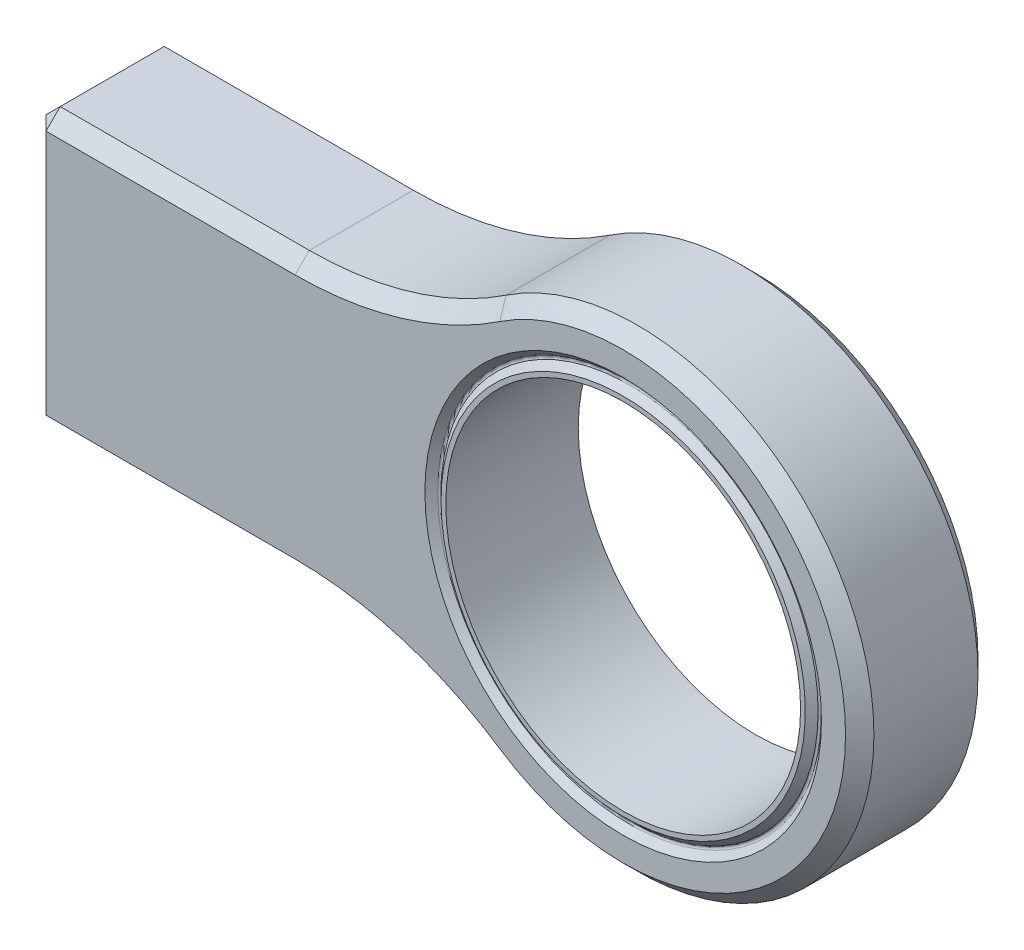
ISO-10303-21;
HEADER;
FILE_DESCRIPTION(('STEP AP214'),'2;1');
FILE_NAME('part.step','',(''),(''),'','','');
FILE_SCHEMA(('AUTOMOTIVE_DESIGN { 1 0 10303 214 1 1 1 1 }'));
ENDSEC;
DATA;
#1=APPLICATION_CONTEXT('core data for automotive mechanical design processes');
#2=APPLICATION_PROTOCOL_DEFINITION('international standard','automotive_design',2000,#1);
#3=PRODUCT_CONTEXT('',#1,'mechanical');
#4=PRODUCT('Part','Part','',(#3));
#5=PRODUCT_RELATED_PRODUCT_CATEGORY('part','',(#4));
#6=PRODUCT_DEFINITION_FORMATION('','',#4);
#7=PRODUCT_DEFINITION_CONTEXT('part definition',#1,'design');
#8=PRODUCT_DEFINITION('design','',#6,#7);
#9=PRODUCT_DEFINITION_SHAPE('','',#8);
#10=(LENGTH_UNIT() NAMED_UNIT(*) SI_UNIT(.MILLI.,.METRE.));
#11=(NAMED_UNIT(*) PLANE_ANGLE_UNIT() SI_UNIT($,.RADIAN.));
#12=(NAMED_UNIT(*) SI_UNIT($,.STERADIAN.) SOLID_ANGLE_UNIT());
#13=UNCERTAINTY_MEASURE_WITH_UNIT(LENGTH_MEASURE(1.E-05),#10,'distance_accuracy_value','');
#14=(GEOMETRIC_REPRESENTATION_CONTEXT(3) GLOBAL_UNCERTAINTY_ASSIGNED_CONTEXT((#13)) GLOBAL_UNIT_ASSIGNED_CONTEXT((#10,
#11,#12)) REPRESENTATION_CONTEXT('',''));
#15=CARTESIAN_POINT('',(0.,0.,0.));
#16=DIRECTION('',(0.,0.,1.));
#17=DIRECTION('',(1.,0.,0.));
#18=AXIS2_PLACEMENT_3D('',#15,#16,#17);
#19=CARTESIAN_POINT('',(0.,0.,3.556));
#20=DIRECTION('',(0.,0.,1.));
#21=DIRECTION('',(1.,0.,0.));
#22=AXIS2_PLACEMENT_3D('',#19,#20,#21);
#23=PLANE('',#22);
#24=CARTESIAN_POINT('',(0.,0.,3.556));
#25=DIRECTION('',(0.,0.,-1.));
#26=DIRECTION('',(-1.,0.,0.));
#27=AXIS2_PLACEMENT_3D('',#24,#25,#26);
#28=CIRCLE('',#27,9.779);
#29=CARTESIAN_POINT('',(-9.779,0.,3.556));
#30=VERTEX_POINT('',#29);
#31=EDGE_CURVE('E404',#30,#30,#28,.T.);
#32=ORIENTED_EDGE('',*,*,#31,.F.);
#33=EDGE_LOOP('',(#32));
#34=FACE_BOUND('',#33,.T.);
#35=CARTESIAN_POINT('',(0.,0.,3.556));
#36=DIRECTION('',(0.,0.,1.));
#37=DIRECTION('',(1.,0.,0.));
#38=AXIS2_PLACEMENT_3D('',#35,#36,#37);
#39=CIRCLE('',#38,9.525);
#40=CARTESIAN_POINT('',(9.525,0.,3.556));
#41=VERTEX_POINT('',#40);
#42=EDGE_CURVE('E169',#41,#41,#39,.T.);
#43=ORIENTED_EDGE('',*,*,#42,.F.);
#44=EDGE_LOOP('',(#43));
#45=FACE_BOUND('',#44,.T.);
#46=ADVANCED_FACE('F41',(#34,#45),#23,.T.);
#47=CARTESIAN_POINT('',(0.,0.,-3.556));
#48=DIRECTION('',(0.,0.,1.));
#49=DIRECTION('',(1.,0.,0.));
#50=AXIS2_PLACEMENT_3D('',#47,#48,#49);
#51=PLANE('',#50);
#52=CARTESIAN_POINT('',(0.,0.,-3.556));
#53=DIRECTION('',(0.,0.,-1.));
#54=DIRECTION('',(-1.,0.,0.));
#55=AXIS2_PLACEMENT_3D('',#52,#53,#54);
#56=CIRCLE('',#55,9.779);
#57=CARTESIAN_POINT('',(-9.779,0.,-3.556));
#58=VERTEX_POINT('',#57);
#59=EDGE_CURVE('E270',#58,#58,#56,.T.);
#60=ORIENTED_EDGE('',*,*,#59,.T.);
#61=EDGE_LOOP('',(#60));
#62=FACE_BOUND('',#61,.T.);
#63=CARTESIAN_POINT('',(0.,0.,-3.556));
#64=DIRECTION('',(0.,0.,1.));
#65=DIRECTION('',(1.,0.,0.));
#66=AXIS2_PLACEMENT_3D('',#63,#64,#65);
#67=CIRCLE('',#66,9.525);
#68=CARTESIAN_POINT('',(9.525,0.,-3.556));
#69=VERTEX_POINT('',#68);
#70=EDGE_CURVE('E201',#69,#69,#67,.T.);
#71=ORIENTED_EDGE('',*,*,#70,.T.);
#72=EDGE_LOOP('',(#71));
#73=FACE_BOUND('',#72,.T.);
#74=ADVANCED_FACE('F372',(#62,#73),#51,.F.);
#75=CARTESIAN_POINT('',(0.,0.,3.556));
#76=DIRECTION('',(0.,0.,-1.));
#77=DIRECTION('',(-1.,0.,0.));
#78=AXIS2_PLACEMENT_3D('',#75,#76,#77);
#79=CIRCLE('',#78,10.6462102448428);
#80=CARTESIAN_POINT('',(-10.6462102448428,0.,3.556));
#81=VERTEX_POINT('',#80);
#82=EDGE_CURVE('E394',#81,#81,#79,.T.);
#83=ORIENTED_EDGE('',*,*,#82,.T.);
#84=EDGE_LOOP('',(#83));
#85=FACE_BOUND('',#84,.T.);
#86=CARTESIAN_POINT('',(-17.6141262627472,26.416,3.556));
#87=DIRECTION('',(0.,0.,1.));
#88=DIRECTION('',(1.,0.,0.));
#89=AXIS2_PLACEMENT_3D('',#86,#87,#88);
#90=CIRCLE('',#89,19.812);
#91=CARTESIAN_POINT('',(-6.62291147479294,9.93241600000001,3.556));
#92=VERTEX_POINT('',#91);
#93=CARTESIAN_POINT('',(-17.6141262627472,6.60400000000001,3.556));
#94=VERTEX_POINT('',#93);
#95=EDGE_CURVE('E244',#92,#94,#90,.F.);
#96=ORIENTED_EDGE('',*,*,#95,.T.);
#97=DIRECTION('',(-1.,0.,0.));
#98=VECTOR('',#97,1.);
#99=CARTESIAN_POINT('',(-31.75,6.60400000000001,3.556));
#100=LINE('',#99,#98);
#101=CARTESIAN_POINT('',(-30.988,6.60400000000001,3.556));
#102=VERTEX_POINT('',#101);
#103=EDGE_CURVE('E180',#94,#102,#100,.T.);
#104=ORIENTED_EDGE('',*,*,#103,.T.);
#105=DIRECTION('',(0.,-1.,0.));
#106=VECTOR('',#105,1.);
#107=CARTESIAN_POINT('',(-30.988,-7.366,3.556));
#108=LINE('',#107,#106);
#109=CARTESIAN_POINT('',(-30.988,-6.60400000000001,3.556));
#110=VERTEX_POINT('',#109);
#111=EDGE_CURVE('E238',#102,#110,#108,.T.);
#112=ORIENTED_EDGE('',*,*,#111,.T.);
#113=DIRECTION('',(1.,0.,0.));
#114=VECTOR('',#113,1.);
#115=CARTESIAN_POINT('',(-17.6141262627472,-6.60400000000001,3.556));
#116=LINE('',#115,#114);
#117=CARTESIAN_POINT('',(-17.6141262627472,-6.60400000000001,3.556));
#118=VERTEX_POINT('',#117);
#119=EDGE_CURVE('E236',#110,#118,#116,.T.);
#120=ORIENTED_EDGE('',*,*,#119,.T.);
#121=CARTESIAN_POINT('',(-17.6141262627472,-26.416,3.556));
#122=DIRECTION('',(0.,0.,1.));
#123=DIRECTION('',(1.,0.,0.));
#124=AXIS2_PLACEMENT_3D('',#121,#122,#123);
#125=CIRCLE('',#124,19.812);
#126=CARTESIAN_POINT('',(-6.62291147479294,-9.93241600000001,3.556));
#127=VERTEX_POINT('',#126);
#128=EDGE_CURVE('E240',#118,#127,#125,.F.);
#129=ORIENTED_EDGE('',*,*,#128,.T.);
#130=CARTESIAN_POINT('',(0.,0.,3.556));
#131=DIRECTION('',(0.,0.,1.));
#132=DIRECTION('',(1.,0.,0.));
#133=AXIS2_PLACEMENT_3D('',#130,#131,#132);
#134=CIRCLE('',#133,11.938);
#135=EDGE_CURVE('E242',#127,#92,#134,.T.);
#136=ORIENTED_EDGE('',*,*,#135,.T.);
#137=EDGE_LOOP('',(#96,#104,#112,#120,#129,#136));
#138=FACE_BOUND('',#137,.T.);
#139=ADVANCED_FACE('F344',(#85,#138),#23,.T.);
#140=CARTESIAN_POINT('',(0.,0.,-3.556));
#141=DIRECTION('',(0.,0.,-1.));
#142=DIRECTION('',(-1.,0.,0.));
#143=AXIS2_PLACEMENT_3D('',#140,#141,#142);
#144=CIRCLE('',#143,10.6462102448428);
#145=CARTESIAN_POINT('',(-10.6462102448428,0.,-3.556));
#146=VERTEX_POINT('',#145);
#147=EDGE_CURVE('E407',#146,#146,#144,.T.);
#148=ORIENTED_EDGE('',*,*,#147,.F.);
#149=EDGE_LOOP('',(#148));
#150=FACE_BOUND('',#149,.T.);
#151=DIRECTION('',(0.,1.,0.));
#152=VECTOR('',#151,1.);
#153=CARTESIAN_POINT('',(-30.988,0.,-3.556));
#154=LINE('',#153,#152);
#155=CARTESIAN_POINT('',(-30.988,-6.60400000000001,-3.556));
#156=VERTEX_POINT('',#155);
#157=CARTESIAN_POINT('',(-30.988,6.60400000000001,-3.556));
#158=VERTEX_POINT('',#157);
#159=EDGE_CURVE('E223',#156,#158,#154,.T.);
#160=ORIENTED_EDGE('',*,*,#159,.T.);
#161=DIRECTION('',(1.,0.,0.));
#162=VECTOR('',#161,1.);
#163=CARTESIAN_POINT('',(0.,6.60400000000001,-3.556));
#164=LINE('',#163,#162);
#165=CARTESIAN_POINT('',(-17.6141262627472,6.60400000000001,-3.556));
#166=VERTEX_POINT('',#165);
#167=EDGE_CURVE('E233',#158,#166,#164,.T.);
#168=ORIENTED_EDGE('',*,*,#167,.T.);
#169=CARTESIAN_POINT('',(-17.6141262627472,26.416,-3.556));
#170=DIRECTION('',(0.,0.,1.));
#171=DIRECTION('',(1.,0.,0.));
#172=AXIS2_PLACEMENT_3D('',#169,#170,#171);
#173=CIRCLE('',#172,19.812);
#174=CARTESIAN_POINT('',(-6.62291147479294,9.93241600000001,-3.556));
#175=VERTEX_POINT('',#174);
#176=EDGE_CURVE('E231',#166,#175,#173,.T.);
#177=ORIENTED_EDGE('',*,*,#176,.T.);
#178=CARTESIAN_POINT('',(0.,0.,-3.556));
#179=DIRECTION('',(0.,0.,1.));
#180=DIRECTION('',(1.,0.,0.));
#181=AXIS2_PLACEMENT_3D('',#178,#179,#180);
#182=CIRCLE('',#181,11.938);
#183=CARTESIAN_POINT('',(-6.62291147479294,-9.93241600000001,-3.556));
#184=VERTEX_POINT('',#183);
#185=EDGE_CURVE('E229',#175,#184,#182,.F.);
#186=ORIENTED_EDGE('',*,*,#185,.T.);
#187=CARTESIAN_POINT('',(-17.6141262627472,-26.416,-3.556));
#188=DIRECTION('',(0.,0.,1.));
#189=DIRECTION('',(1.,0.,0.));
#190=AXIS2_PLACEMENT_3D('',#187,#188,#189);
#191=CIRCLE('',#190,19.812);
#192=CARTESIAN_POINT('',(-17.6141262627472,-6.60400000000001,-3.556));
#193=VERTEX_POINT('',#192);
#194=EDGE_CURVE('E227',#184,#193,#191,.T.);
#195=ORIENTED_EDGE('',*,*,#194,.T.);
#196=DIRECTION('',(-1.,0.,0.));
#197=VECTOR('',#196,1.);
#198=CARTESIAN_POINT('',(0.,-6.60400000000001,-3.556));
#199=LINE('',#198,#197);
#200=EDGE_CURVE('E225',#193,#156,#199,.T.);
#201=ORIENTED_EDGE('',*,*,#200,.T.);
#202=EDGE_LOOP('',(#160,#168,#177,#186,#195,#201));
#203=FACE_BOUND('',#202,.T.);
#204=ADVANCED_FACE('F382',(#150,#203),#51,.F.);
#205=CARTESIAN_POINT('',(-31.75,7.366,3.556));
#206=DIRECTION('',(0.,-1.,0.));
#207=DIRECTION('',(0.,0.,-1.));
#208=AXIS2_PLACEMENT_3D('',#205,#206,#207);
#209=PLANE('',#208);
#210=DIRECTION('',(0.,0.,1.));
#211=VECTOR('',#210,1.);
#212=CARTESIAN_POINT('',(-17.6141262627472,7.366,-3.556));
#213=LINE('',#212,#211);
#214=CARTESIAN_POINT('',(-17.6141262627472,7.366,2.794));
#215=VERTEX_POINT('',#214);
#216=CARTESIAN_POINT('',(-17.6141262627472,7.366,-2.794));
#217=VERTEX_POINT('',#216);
#218=EDGE_CURVE('E150',#215,#217,#213,.F.);
#219=ORIENTED_EDGE('',*,*,#218,.T.);
#220=DIRECTION('',(-1.,0.,0.));
#221=VECTOR('',#220,1.);
#222=CARTESIAN_POINT('',(-31.75,7.366,-2.794));
#223=LINE('',#222,#221);
#224=CARTESIAN_POINT('',(-30.988,7.366,-2.794));
#225=VERTEX_POINT('',#224);
#226=EDGE_CURVE('E158',#217,#225,#223,.T.);
#227=ORIENTED_EDGE('',*,*,#226,.T.);
#228=DIRECTION('',(0.,0.,1.));
#229=VECTOR('',#228,1.);
#230=CARTESIAN_POINT('',(-30.988,7.366,3.556));
#231=LINE('',#230,#229);
#232=CARTESIAN_POINT('',(-30.988,7.366,2.794));
#233=VERTEX_POINT('',#232);
#234=EDGE_CURVE('E153',#225,#233,#231,.T.);
#235=ORIENTED_EDGE('',*,*,#234,.T.);
#236=DIRECTION('',(1.,0.,0.));
#237=VECTOR('',#236,1.);
#238=CARTESIAN_POINT('',(-17.6141262627472,7.366,2.794));
#239=LINE('',#238,#237);
#240=EDGE_CURVE('E146',#233,#215,#239,.T.);
#241=ORIENTED_EDGE('',*,*,#240,.T.);
#242=EDGE_LOOP('',(#219,#227,#235,#241));
#243=FACE_BOUND('',#242,.T.);
#244=ADVANCED_FACE('F148',(#243),#209,.F.);
#245=CARTESIAN_POINT('',(-31.75,7.366,3.556));
#246=DIRECTION('',(1.,0.,0.));
#247=DIRECTION('',(0.,0.,-1.));
#248=AXIS2_PLACEMENT_3D('',#245,#246,#247);
#249=PLANE('',#248);
#250=DIRECTION('',(0.,1.,0.));
#251=VECTOR('',#250,1.);
#252=CARTESIAN_POINT('',(-31.75,7.366,2.794));
#253=LINE('',#252,#251);
#254=CARTESIAN_POINT('',(-31.75,-6.60400000000001,2.794));
#255=VERTEX_POINT('',#254);
#256=CARTESIAN_POINT('',(-31.75,6.60400000000001,2.794));
#257=VERTEX_POINT('',#256);
#258=EDGE_CURVE('E262',#255,#257,#253,.T.);
#259=ORIENTED_EDGE('',*,*,#258,.T.);
#260=DIRECTION('',(0.,0.,-1.));
#261=VECTOR('',#260,1.);
#262=CARTESIAN_POINT('',(-31.75,6.60400000000001,3.556));
#263=LINE('',#262,#261);
#264=CARTESIAN_POINT('',(-31.75,6.60400000000001,-2.79400000000001));
#265=VERTEX_POINT('',#264);
#266=EDGE_CURVE('E11',#257,#265,#263,.T.);
#267=ORIENTED_EDGE('',*,*,#266,.T.);
#268=DIRECTION('',(0.,-1.,0.));
#269=VECTOR('',#268,1.);
#270=CARTESIAN_POINT('',(-31.75,7.366,-2.79400000000001));
#271=LINE('',#270,#269);
#272=CARTESIAN_POINT('',(-31.75,-6.60400000000001,-2.79400000000001));
#273=VERTEX_POINT('',#272);
#274=EDGE_CURVE('E51',#265,#273,#271,.T.);
#275=ORIENTED_EDGE('',*,*,#274,.T.);
#276=DIRECTION('',(0.,0.,1.));
#277=VECTOR('',#276,1.);
#278=CARTESIAN_POINT('',(-31.75,-6.60400000000001,3.556));
#279=LINE('',#278,#277);
#280=EDGE_CURVE('E264',#273,#255,#279,.T.);
#281=ORIENTED_EDGE('',*,*,#280,.T.);
#282=EDGE_LOOP('',(#259,#267,#275,#281));
#283=FACE_BOUND('',#282,.T.);
#284=ADVANCED_FACE('F315',(#283),#249,.F.);
#285=CARTESIAN_POINT('',(-31.75,-7.366,3.556));
#286=DIRECTION('',(0.,1.,0.));
#287=DIRECTION('',(0.,0.,1.));
#288=AXIS2_PLACEMENT_3D('',#285,#286,#287);
#289=PLANE('',#288);
#290=DIRECTION('',(0.,0.,-1.));
#291=VECTOR('',#290,1.);
#292=CARTESIAN_POINT('',(-30.988,-7.366,3.556));
#293=LINE('',#292,#291);
#294=CARTESIAN_POINT('',(-30.988,-7.366,2.794));
#295=VERTEX_POINT('',#294);
#296=CARTESIAN_POINT('',(-30.988,-7.366,-2.794));
#297=VERTEX_POINT('',#296);
#298=EDGE_CURVE('E258',#295,#297,#293,.T.);
#299=ORIENTED_EDGE('',*,*,#298,.T.);
#300=DIRECTION('',(1.,0.,0.));
#301=VECTOR('',#300,1.);
#302=CARTESIAN_POINT('',(-31.75,-7.366,-2.794));
#303=LINE('',#302,#301);
#304=CARTESIAN_POINT('',(-17.6141262627472,-7.366,-2.794));
#305=VERTEX_POINT('',#304);
#306=EDGE_CURVE('E260',#297,#305,#303,.T.);
#307=ORIENTED_EDGE('',*,*,#306,.T.);
#308=DIRECTION('',(0.,0.,1.));
#309=VECTOR('',#308,1.);
#310=CARTESIAN_POINT('',(-17.6141262627472,-7.366,3.556));
#311=LINE('',#310,#309);
#312=CARTESIAN_POINT('',(-17.6141262627472,-7.366,2.794));
#313=VERTEX_POINT('',#312);
#314=EDGE_CURVE('E218',#305,#313,#311,.T.);
#315=ORIENTED_EDGE('',*,*,#314,.T.);
#316=DIRECTION('',(-1.,0.,0.));
#317=VECTOR('',#316,1.);
#318=CARTESIAN_POINT('',(-31.75,-7.366,2.794));
#319=LINE('',#318,#317);
#320=EDGE_CURVE('E256',#313,#295,#319,.T.);
#321=ORIENTED_EDGE('',*,*,#320,.T.);
#322=EDGE_LOOP('',(#299,#307,#315,#321));
#323=FACE_BOUND('',#322,.T.);
#324=ADVANCED_FACE('F335',(#323),#289,.F.);
#325=CARTESIAN_POINT('',(0.,0.,3.556));
#326=DIRECTION('',(0.,0.,-1.));
#327=DIRECTION('',(-1.,0.,0.));
#328=AXIS2_PLACEMENT_3D('',#325,#326,#327);
#329=CYLINDRICAL_SURFACE('',#328,12.7);
#330=DIRECTION('',(0.,0.,-1.));
#331=VECTOR('',#330,1.);
#332=CARTESIAN_POINT('',(-7.04565050509887,-10.5664,3.556));
#333=LINE('',#332,#331);
#334=CARTESIAN_POINT('',(-7.04565050509887,-10.5664,2.794));
#335=VERTEX_POINT('',#334);
#336=CARTESIAN_POINT('',(-7.04565050509887,-10.5664,-2.794));
#337=VERTEX_POINT('',#336);
#338=EDGE_CURVE('E168',#335,#337,#333,.T.);
#339=ORIENTED_EDGE('',*,*,#338,.T.);
#340=CARTESIAN_POINT('',(0.,0.,-2.794));
#341=DIRECTION('',(0.,0.,1.));
#342=DIRECTION('',(1.,0.,0.));
#343=AXIS2_PLACEMENT_3D('',#340,#341,#342);
#344=CIRCLE('',#343,12.7);
#345=CARTESIAN_POINT('',(-7.04565050509887,10.5664,-2.794));
#346=VERTEX_POINT('',#345);
#347=EDGE_CURVE('E250',#337,#346,#344,.T.);
#348=ORIENTED_EDGE('',*,*,#347,.T.);
#349=DIRECTION('',(0.,0.,-1.));
#350=VECTOR('',#349,1.);
#351=CARTESIAN_POINT('',(-7.04565050509887,10.5664,3.556));
#352=LINE('',#351,#350);
#353=CARTESIAN_POINT('',(-7.04565050509887,10.5664,2.794));
#354=VERTEX_POINT('',#353);
#355=EDGE_CURVE('E216',#346,#354,#352,.F.);
#356=ORIENTED_EDGE('',*,*,#355,.T.);
#357=CARTESIAN_POINT('',(0.,0.,2.794));
#358=DIRECTION('',(0.,0.,1.));
#359=DIRECTION('',(1.,0.,0.));
#360=AXIS2_PLACEMENT_3D('',#357,#358,#359);
#361=CIRCLE('',#360,12.7);
#362=EDGE_CURVE('E248',#354,#335,#361,.F.);
#363=ORIENTED_EDGE('',*,*,#362,.T.);
#364=EDGE_LOOP('',(#339,#348,#356,#363));
#365=FACE_BOUND('',#364,.T.);
#366=ADVANCED_FACE('F347',(#365),#329,.T.);
#367=CARTESIAN_POINT('',(0.,0.,3.556));
#368=DIRECTION('',(0.,0.,-1.));
#369=DIRECTION('',(-1.,0.,0.));
#370=AXIS2_PLACEMENT_3D('',#367,#368,#369);
#371=CYLINDRICAL_SURFACE('',#370,9.525);
#372=ORIENTED_EDGE('',*,*,#42,.T.);
#373=EDGE_LOOP('',(#372));
#374=FACE_BOUND('',#373,.T.);
#375=ORIENTED_EDGE('',*,*,#70,.F.);
#376=EDGE_LOOP('',(#375));
#377=FACE_BOUND('',#376,.T.);
#378=ADVANCED_FACE('F429',(#374,#377),#371,.F.);
#379=CARTESIAN_POINT('',(-17.6141262627472,26.416,3.556));
#380=DIRECTION('',(0.,0.,-1.));
#381=DIRECTION('',(-1.,0.,0.));
#382=AXIS2_PLACEMENT_3D('',#379,#380,#381);
#383=CYLINDRICAL_SURFACE('',#382,19.05);
#384=ORIENTED_EDGE('',*,*,#355,.F.);
#385=CARTESIAN_POINT('',(-17.6141262627472,26.416,-2.794));
#386=DIRECTION('',(0.,0.,1.));
#387=DIRECTION('',(1.,0.,0.));
#388=AXIS2_PLACEMENT_3D('',#385,#386,#387);
#389=CIRCLE('',#388,19.05);
#390=EDGE_CURVE('E167',#346,#217,#389,.F.);
#391=ORIENTED_EDGE('',*,*,#390,.T.);
#392=ORIENTED_EDGE('',*,*,#218,.F.);
#393=CARTESIAN_POINT('',(-17.6141262627472,26.416,2.794));
#394=DIRECTION('',(0.,0.,1.));
#395=DIRECTION('',(1.,0.,0.));
#396=AXIS2_PLACEMENT_3D('',#393,#394,#395);
#397=CIRCLE('',#396,19.05);
#398=EDGE_CURVE('E164',#215,#354,#397,.T.);
#399=ORIENTED_EDGE('',*,*,#398,.T.);
#400=EDGE_LOOP('',(#384,#391,#392,#399));
#401=FACE_BOUND('',#400,.T.);
#402=ADVANCED_FACE('F163',(#401),#383,.F.);
#403=CARTESIAN_POINT('',(-17.6141262627472,-26.416,3.556));
#404=DIRECTION('',(0.,0.,-1.));
#405=DIRECTION('',(-1.,0.,0.));
#406=AXIS2_PLACEMENT_3D('',#403,#404,#405);
#407=CYLINDRICAL_SURFACE('',#406,19.05);
#408=ORIENTED_EDGE('',*,*,#314,.F.);
#409=CARTESIAN_POINT('',(-17.6141262627472,-26.416,-2.794));
#410=DIRECTION('',(0.,0.,1.));
#411=DIRECTION('',(1.,0.,0.));
#412=AXIS2_PLACEMENT_3D('',#409,#410,#411);
#413=CIRCLE('',#412,19.05);
#414=EDGE_CURVE('E254',#305,#337,#413,.F.);
#415=ORIENTED_EDGE('',*,*,#414,.T.);
#416=ORIENTED_EDGE('',*,*,#338,.F.);
#417=CARTESIAN_POINT('',(-17.6141262627472,-26.416,2.794));
#418=DIRECTION('',(0.,0.,1.));
#419=DIRECTION('',(1.,0.,0.));
#420=AXIS2_PLACEMENT_3D('',#417,#418,#419);
#421=CIRCLE('',#420,19.05);
#422=EDGE_CURVE('E252',#335,#313,#421,.T.);
#423=ORIENTED_EDGE('',*,*,#422,.T.);
#424=EDGE_LOOP('',(#408,#415,#416,#423));
#425=FACE_BOUND('',#424,.T.);
#426=ADVANCED_FACE('F337',(#425),#407,.F.);
#427=CARTESIAN_POINT('',(-17.6141262627472,-26.416,3.556));
#428=DIRECTION('',(0.,0.,1.));
#429=DIRECTION('',(1.,0.,0.));
#430=AXIS2_PLACEMENT_3D('',#427,#428,#429);
#431=CONICAL_SURFACE('',#430,19.812,0.785398163397444);
#432=DIRECTION('',(0.,0.707106781186544,0.707106781186551));
#433=VECTOR('',#432,1.);
#434=CARTESIAN_POINT('',(-17.6141262627472,-7.366,2.794));
#435=LINE('',#434,#433);
#436=EDGE_CURVE('E194',#313,#118,#435,.T.);
#437=ORIENTED_EDGE('',*,*,#436,.F.);
#438=ORIENTED_EDGE('',*,*,#422,.F.);
#439=DIRECTION('',(-0.392285610238253,-0.588312841947205,-0.707106781186551));
#440=VECTOR('',#439,1.);
#441=CARTESIAN_POINT('',(-6.62291147479294,-9.93241600000001,3.556));
#442=LINE('',#441,#440);
#443=EDGE_CURVE('E46',#127,#335,#442,.T.);
#444=ORIENTED_EDGE('',*,*,#443,.F.);
#445=ORIENTED_EDGE('',*,*,#128,.F.);
#446=EDGE_LOOP('',(#437,#438,#444,#445));
#447=FACE_BOUND('',#446,.T.);
#448=ADVANCED_FACE('F44',(#447),#431,.F.);
#449=CARTESIAN_POINT('',(0.,0.,3.556));
#450=DIRECTION('',(0.,0.,-1.));
#451=DIRECTION('',(-1.,0.,0.));
#452=AXIS2_PLACEMENT_3D('',#449,#450,#451);
#453=CONICAL_SURFACE('',#452,11.938,0.785398163397444);
#454=ORIENTED_EDGE('',*,*,#443,.T.);
#455=ORIENTED_EDGE('',*,*,#362,.F.);
#456=DIRECTION('',(-0.392285610238253,0.588312841947205,-0.707106781186551));
#457=VECTOR('',#456,1.);
#458=CARTESIAN_POINT('',(-6.62291147479294,9.93241600000001,3.556));
#459=LINE('',#458,#457);
#460=EDGE_CURVE('E179',#92,#354,#459,.T.);
#461=ORIENTED_EDGE('',*,*,#460,.F.);
#462=ORIENTED_EDGE('',*,*,#135,.F.);
#463=EDGE_LOOP('',(#454,#455,#461,#462));
#464=FACE_BOUND('',#463,.T.);
#465=ADVANCED_FACE('F345',(#464),#453,.T.);
#466=CARTESIAN_POINT('',(0.,-6.60400000000001,3.556));
#467=DIRECTION('',(0.,-0.707106781186551,0.707106781186544));
#468=DIRECTION('',(-1.,0.,0.));
#469=AXIS2_PLACEMENT_3D('',#466,#467,#468);
#470=PLANE('',#469);
#471=ORIENTED_EDGE('',*,*,#436,.T.);
#472=ORIENTED_EDGE('',*,*,#119,.F.);
#473=DIRECTION('',(0.,0.707106781186544,0.707106781186551));
#474=VECTOR('',#473,1.);
#475=CARTESIAN_POINT('',(-30.988,-6.985,3.175));
#476=LINE('',#475,#474);
#477=EDGE_CURVE('E184',#295,#110,#476,.T.);
#478=ORIENTED_EDGE('',*,*,#477,.F.);
#479=ORIENTED_EDGE('',*,*,#320,.F.);
#480=EDGE_LOOP('',(#471,#472,#478,#479));
#481=FACE_BOUND('',#480,.T.);
#482=ADVANCED_FACE('F342',(#481),#470,.T.);
#483=CARTESIAN_POINT('',(-17.6141262627472,26.416,3.556));
#484=DIRECTION('',(0.,0.,1.));
#485=DIRECTION('',(1.,0.,0.));
#486=AXIS2_PLACEMENT_3D('',#483,#484,#485);
#487=CONICAL_SURFACE('',#486,19.812,0.785398163397446);
#488=ORIENTED_EDGE('',*,*,#460,.T.);
#489=ORIENTED_EDGE('',*,*,#398,.F.);
#490=DIRECTION('',(0.,0.707106781186544,-0.707106781186551));
#491=VECTOR('',#490,1.);
#492=CARTESIAN_POINT('',(-17.6141262627472,6.60400000000001,3.556));
#493=LINE('',#492,#491);
#494=EDGE_CURVE('E176',#94,#215,#493,.T.);
#495=ORIENTED_EDGE('',*,*,#494,.F.);
#496=ORIENTED_EDGE('',*,*,#95,.F.);
#497=EDGE_LOOP('',(#488,#489,#495,#496));
#498=FACE_BOUND('',#497,.T.);
#499=ADVANCED_FACE('F174',(#498),#487,.F.);
#500=CARTESIAN_POINT('',(-31.75,-6.60400000000001,2.794));
#501=DIRECTION('',(-0.577350269189626,-0.577350269189631,0.577350269189621));
#502=DIRECTION('',(0.707106781186551,-0.707106781186544,0.));
#503=AXIS2_PLACEMENT_3D('',#500,#501,#502);
#504=PLANE('',#503);
#505=DIRECTION('',(-0.707106781186551,0.707106781186544,0.));
#506=VECTOR('',#505,1.);
#507=CARTESIAN_POINT('',(-31.75,-6.60400000000001,2.794));
#508=LINE('',#507,#506);
#509=EDGE_CURVE('E190',#295,#255,#508,.T.);
#510=ORIENTED_EDGE('',*,*,#509,.F.);
#511=ORIENTED_EDGE('',*,*,#477,.T.);
#512=DIRECTION('',(-0.707106781186544,0.,-0.707106781186551));
#513=VECTOR('',#512,1.);
#514=CARTESIAN_POINT('',(-31.75,-6.60400000000001,2.794));
#515=LINE('',#514,#513);
#516=EDGE_CURVE('E185',#255,#110,#515,.F.);
#517=ORIENTED_EDGE('',*,*,#516,.F.);
#518=EDGE_LOOP('',(#510,#511,#517));
#519=FACE_BOUND('',#518,.T.);
#520=ADVANCED_FACE('F308',(#519),#504,.T.);
#521=CARTESIAN_POINT('',(0.,6.60400000000001,3.556));
#522=DIRECTION('',(0.,0.707106781186551,0.707106781186544));
#523=DIRECTION('',(1.,0.,0.));
#524=AXIS2_PLACEMENT_3D('',#521,#522,#523);
#525=PLANE('',#524);
#526=ORIENTED_EDGE('',*,*,#494,.T.);
#527=ORIENTED_EDGE('',*,*,#240,.F.);
#528=DIRECTION('',(0.,0.707106781186544,-0.707106781186551));
#529=VECTOR('',#528,1.);
#530=CARTESIAN_POINT('',(-30.988,6.60400000000001,3.556));
#531=LINE('',#530,#529);
#532=EDGE_CURVE('E295',#102,#233,#531,.T.);
#533=ORIENTED_EDGE('',*,*,#532,.F.);
#534=ORIENTED_EDGE('',*,*,#103,.F.);
#535=EDGE_LOOP('',(#526,#527,#533,#534));
#536=FACE_BOUND('',#535,.T.);
#537=ADVANCED_FACE('F182',(#536),#525,.T.);
#538=CARTESIAN_POINT('',(-30.988,0.,3.556));
#539=DIRECTION('',(-0.707106781186551,0.,0.707106781186544));
#540=DIRECTION('',(0.,1.,0.));
#541=AXIS2_PLACEMENT_3D('',#538,#539,#540);
#542=PLANE('',#541);
#543=ORIENTED_EDGE('',*,*,#516,.T.);
#544=ORIENTED_EDGE('',*,*,#111,.F.);
#545=DIRECTION('',(0.707106781186544,0.,0.707106781186551));
#546=VECTOR('',#545,1.);
#547=CARTESIAN_POINT('',(-30.988,6.60400000000001,3.556));
#548=LINE('',#547,#546);
#549=EDGE_CURVE('E293',#257,#102,#548,.T.);
#550=ORIENTED_EDGE('',*,*,#549,.F.);
#551=ORIENTED_EDGE('',*,*,#258,.F.);
#552=EDGE_LOOP('',(#543,#544,#550,#551));
#553=FACE_BOUND('',#552,.T.);
#554=ADVANCED_FACE('F313',(#553),#542,.T.);
#555=CARTESIAN_POINT('',(-30.988,-7.366,3.556));
#556=DIRECTION('',(0.707106781186544,0.707106781186551,0.));
#557=DIRECTION('',(0.,0.,-1.));
#558=AXIS2_PLACEMENT_3D('',#555,#556,#557);
#559=PLANE('',#558);
#560=ORIENTED_EDGE('',*,*,#509,.T.);
#561=ORIENTED_EDGE('',*,*,#280,.F.);
#562=DIRECTION('',(0.707106781186551,-0.707106781186544,0.));
#563=VECTOR('',#562,1.);
#564=CARTESIAN_POINT('',(-31.369,-6.985,-2.794));
#565=LINE('',#564,#563);
#566=EDGE_CURVE('E290',#297,#273,#565,.F.);
#567=ORIENTED_EDGE('',*,*,#566,.F.);
#568=ORIENTED_EDGE('',*,*,#298,.F.);
#569=EDGE_LOOP('',(#560,#561,#567,#568));
#570=FACE_BOUND('',#569,.T.);
#571=ADVANCED_FACE('F304',(#570),#559,.F.);
#572=CARTESIAN_POINT('',(-31.75,-7.366,-2.794));
#573=DIRECTION('',(0.,0.707106781186551,0.707106781186544));
#574=DIRECTION('',(1.,0.,0.));
#575=AXIS2_PLACEMENT_3D('',#572,#573,#574);
#576=PLANE('',#575);
#577=DIRECTION('',(0.,0.707106781186544,-0.707106781186551));
#578=VECTOR('',#577,1.);
#579=CARTESIAN_POINT('',(-30.988,-6.60400000000001,-3.556));
#580=LINE('',#579,#578);
#581=EDGE_CURVE('E287',#156,#297,#580,.F.);
#582=ORIENTED_EDGE('',*,*,#581,.F.);
#583=ORIENTED_EDGE('',*,*,#200,.F.);
#584=DIRECTION('',(0.,0.707106781186544,-0.707106781186551));
#585=VECTOR('',#584,1.);
#586=CARTESIAN_POINT('',(-17.6141262627472,-7.366,-2.794));
#587=LINE('',#586,#585);
#588=EDGE_CURVE('E297',#305,#193,#587,.T.);
#589=ORIENTED_EDGE('',*,*,#588,.F.);
#590=ORIENTED_EDGE('',*,*,#306,.F.);
#591=EDGE_LOOP('',(#582,#583,#589,#590));
#592=FACE_BOUND('',#591,.T.);
#593=ADVANCED_FACE('F330',(#592),#576,.F.);
#594=CARTESIAN_POINT('',(-17.6141262627472,-26.416,-3.556));
#595=DIRECTION('',(0.,0.,-1.));
#596=DIRECTION('',(-1.,0.,0.));
#597=AXIS2_PLACEMENT_3D('',#594,#595,#596);
#598=CONICAL_SURFACE('',#597,19.812,0.785398163397444);
#599=ORIENTED_EDGE('',*,*,#588,.T.);
#600=ORIENTED_EDGE('',*,*,#194,.F.);
#601=DIRECTION('',(0.392285610238253,0.588312841947205,-0.707106781186551));
#602=VECTOR('',#601,1.);
#603=CARTESIAN_POINT('',(-7.04565050509887,-10.5664,-2.794));
#604=LINE('',#603,#602);
#605=EDGE_CURVE('E284',#337,#184,#604,.T.);
#606=ORIENTED_EDGE('',*,*,#605,.F.);
#607=ORIENTED_EDGE('',*,*,#414,.F.);
#608=EDGE_LOOP('',(#599,#600,#606,#607));
#609=FACE_BOUND('',#608,.T.);
#610=ADVANCED_FACE('F484',(#609),#598,.F.);
#611=CARTESIAN_POINT('',(-30.988,6.60400000000001,3.556));
#612=DIRECTION('',(-0.577350269189626,0.577350269189631,0.577350269189621));
#613=DIRECTION('',(-0.707106781186551,-0.707106781186544,0.));
#614=AXIS2_PLACEMENT_3D('',#611,#612,#613);
#615=PLANE('',#614);
#616=ORIENTED_EDGE('',*,*,#549,.T.);
#617=ORIENTED_EDGE('',*,*,#532,.T.);
#618=DIRECTION('',(0.707106781186551,0.707106781186544,0.));
#619=VECTOR('',#618,1.);
#620=CARTESIAN_POINT('',(-31.369,6.985,2.794));
#621=LINE('',#620,#619);
#622=EDGE_CURVE('E281',#257,#233,#621,.T.);
#623=ORIENTED_EDGE('',*,*,#622,.F.);
#624=EDGE_LOOP('',(#616,#617,#623));
#625=FACE_BOUND('',#624,.T.);
#626=ADVANCED_FACE('F479',(#625),#615,.T.);
#627=CARTESIAN_POINT('',(-30.988,-6.60400000000001,-3.556));
#628=DIRECTION('',(-0.577350269189621,-0.577350269189631,-0.577350269189626));
#629=DIRECTION('',(0.,0.707106781186544,-0.707106781186551));
#630=AXIS2_PLACEMENT_3D('',#627,#628,#629);
#631=PLANE('',#630);
#632=ORIENTED_EDGE('',*,*,#581,.T.);
#633=ORIENTED_EDGE('',*,*,#566,.T.);
#634=DIRECTION('',(-0.707106781186551,0.,0.707106781186544));
#635=VECTOR('',#634,1.);
#636=CARTESIAN_POINT('',(-30.988,-6.60400000000001,-3.556));
#637=LINE('',#636,#635);
#638=EDGE_CURVE('E278',#156,#273,#637,.T.);
#639=ORIENTED_EDGE('',*,*,#638,.F.);
#640=EDGE_LOOP('',(#632,#633,#639));
#641=FACE_BOUND('',#640,.T.);
#642=ADVANCED_FACE('F325',(#641),#631,.T.);
#643=CARTESIAN_POINT('',(0.,0.,-2.794));
#644=DIRECTION('',(0.,0.,1.));
#645=DIRECTION('',(1.,0.,0.));
#646=AXIS2_PLACEMENT_3D('',#643,#644,#645);
#647=CONICAL_SURFACE('',#646,12.7,0.785398163397444);
#648=ORIENTED_EDGE('',*,*,#605,.T.);
#649=ORIENTED_EDGE('',*,*,#185,.F.);
#650=DIRECTION('',(0.392285610238253,-0.588312841947205,-0.707106781186551));
#651=VECTOR('',#650,1.);
#652=CARTESIAN_POINT('',(-7.04565050509887,10.5664,-2.794));
#653=LINE('',#652,#651);
#654=EDGE_CURVE('E275',#346,#175,#653,.T.);
#655=ORIENTED_EDGE('',*,*,#654,.F.);
#656=ORIENTED_EDGE('',*,*,#347,.F.);
#657=EDGE_LOOP('',(#648,#649,#655,#656));
#658=FACE_BOUND('',#657,.T.);
#659=ADVANCED_FACE('F353',(#658),#647,.T.);
#660=CARTESIAN_POINT('',(-31.75,6.60400000000001,3.556));
#661=DIRECTION('',(0.707106781186544,-0.707106781186551,0.));
#662=DIRECTION('',(0.,0.,-1.));
#663=AXIS2_PLACEMENT_3D('',#660,#661,#662);
#664=PLANE('',#663);
#665=ORIENTED_EDGE('',*,*,#622,.T.);
#666=ORIENTED_EDGE('',*,*,#234,.F.);
#667=DIRECTION('',(-0.707106781186551,-0.707106781186544,0.));
#668=VECTOR('',#667,1.);
#669=CARTESIAN_POINT('',(-30.988,7.366,-2.794));
#670=LINE('',#669,#668);
#671=EDGE_CURVE('E273',#265,#225,#670,.F.);
#672=ORIENTED_EDGE('',*,*,#671,.F.);
#673=ORIENTED_EDGE('',*,*,#266,.F.);
#674=EDGE_LOOP('',(#665,#666,#672,#673));
#675=FACE_BOUND('',#674,.T.);
#676=ADVANCED_FACE('F318',(#675),#664,.F.);
#677=CARTESIAN_POINT('',(-31.75,7.366,-2.79400000000001));
#678=DIRECTION('',(0.707106781186544,0.,0.707106781186551));
#679=DIRECTION('',(0.,-1.,0.));
#680=AXIS2_PLACEMENT_3D('',#677,#678,#679);
#681=PLANE('',#680);
#682=ORIENTED_EDGE('',*,*,#638,.T.);
#683=ORIENTED_EDGE('',*,*,#274,.F.);
#684=DIRECTION('',(0.707106781186551,0.,-0.707106781186544));
#685=VECTOR('',#684,1.);
#686=CARTESIAN_POINT('',(-31.369,6.60400000000001,-3.175));
#687=LINE('',#686,#685);
#688=EDGE_CURVE('E59',#158,#265,#687,.F.);
#689=ORIENTED_EDGE('',*,*,#688,.F.);
#690=ORIENTED_EDGE('',*,*,#159,.F.);
#691=EDGE_LOOP('',(#682,#683,#689,#690));
#692=FACE_BOUND('',#691,.T.);
#693=ADVANCED_FACE('F320',(#692),#681,.F.);
#694=CARTESIAN_POINT('',(-17.6141262627472,26.416,-3.556));
#695=DIRECTION('',(0.,0.,-1.));
#696=DIRECTION('',(-1.,0.,0.));
#697=AXIS2_PLACEMENT_3D('',#694,#695,#696);
#698=CONICAL_SURFACE('',#697,19.812,0.785398163397446);
#699=ORIENTED_EDGE('',*,*,#654,.T.);
#700=ORIENTED_EDGE('',*,*,#176,.F.);
#701=DIRECTION('',(0.,-0.707106781186544,-0.707106781186551));
#702=VECTOR('',#701,1.);
#703=CARTESIAN_POINT('',(-17.6141262627472,7.366,-2.794));
#704=LINE('',#703,#702);
#705=EDGE_CURVE('E269',#217,#166,#704,.T.);
#706=ORIENTED_EDGE('',*,*,#705,.F.);
#707=ORIENTED_EDGE('',*,*,#390,.F.);
#708=EDGE_LOOP('',(#699,#700,#706,#707));
#709=FACE_BOUND('',#708,.T.);
#710=ADVANCED_FACE('F356',(#709),#698,.F.);
#711=CARTESIAN_POINT('',(-30.988,7.366,-2.794));
#712=DIRECTION('',(-0.577350269189621,0.577350269189631,-0.577350269189626));
#713=DIRECTION('',(0.,0.707106781186544,0.707106781186551));
#714=AXIS2_PLACEMENT_3D('',#711,#712,#713);
#715=PLANE('',#714);
#716=ORIENTED_EDGE('',*,*,#688,.T.);
#717=ORIENTED_EDGE('',*,*,#671,.T.);
#718=DIRECTION('',(0.,0.707106781186544,0.707106781186551));
#719=VECTOR('',#718,1.);
#720=CARTESIAN_POINT('',(-30.988,7.366,-2.794));
#721=LINE('',#720,#719);
#722=EDGE_CURVE('E267',#158,#225,#721,.T.);
#723=ORIENTED_EDGE('',*,*,#722,.F.);
#724=EDGE_LOOP('',(#716,#717,#723));
#725=FACE_BOUND('',#724,.T.);
#726=ADVANCED_FACE('F360',(#725),#715,.T.);
#727=CARTESIAN_POINT('',(-31.75,7.366,-2.794));
#728=DIRECTION('',(0.,-0.707106781186551,0.707106781186544));
#729=DIRECTION('',(-1.,0.,0.));
#730=AXIS2_PLACEMENT_3D('',#727,#728,#729);
#731=PLANE('',#730);
#732=ORIENTED_EDGE('',*,*,#705,.T.);
#733=ORIENTED_EDGE('',*,*,#167,.F.);
#734=ORIENTED_EDGE('',*,*,#722,.T.);
#735=ORIENTED_EDGE('',*,*,#226,.F.);
#736=EDGE_LOOP('',(#732,#733,#734,#735));
#737=FACE_BOUND('',#736,.T.);
#738=ADVANCED_FACE('F359',(#737),#731,.F.);
#739=CARTESIAN_POINT('',(0.,0.,-3.556));
#740=DIRECTION('',(0.,0.,1.));
#741=DIRECTION('',(1.,0.,0.));
#742=AXIS2_PLACEMENT_3D('',#739,#740,#741);
#743=CONICAL_SURFACE('',#742,9.779,0.785398163397446);
#744=CARTESIAN_POINT('',(0.,0.,-3.21219743878931));
#745=DIRECTION('',(0.,0.,-1.));
#746=DIRECTION('',(-1.,0.,0.));
#747=AXIS2_PLACEMENT_3D('',#744,#745,#746);
#748=CIRCLE('',#747,10.1228025612107);
#749=CARTESIAN_POINT('',(-10.1228025612107,0.,-3.21219743878931));
#750=VERTEX_POINT('',#749);
#751=EDGE_CURVE('E413',#750,#750,#748,.T.);
#752=ORIENTED_EDGE('',*,*,#751,.T.);
#753=EDGE_LOOP('',(#752));
#754=FACE_BOUND('',#753,.T.);
#755=ORIENTED_EDGE('',*,*,#59,.F.);
#756=EDGE_LOOP('',(#755));
#757=FACE_BOUND('',#756,.T.);
#758=ADVANCED_FACE('F367',(#754,#757),#743,.T.);
#759=CARTESIAN_POINT('',(0.,0.,-3.302));
#760=DIRECTION('',(0.,0.,-1.));
#761=DIRECTION('',(-1.,0.,0.));
#762=AXIS2_PLACEMENT_3D('',#759,#760,#761);
#763=TOROIDAL_SURFACE('',#762,10.2126051224214,0.127);
#764=CARTESIAN_POINT('',(0.,0.,-3.21219743878931));
#765=DIRECTION('',(0.,0.,-1.));
#766=DIRECTION('',(-1.,0.,0.));
#767=AXIS2_PLACEMENT_3D('',#764,#765,#766);
#768=CIRCLE('',#767,10.3024076836321);
#769=CARTESIAN_POINT('',(-10.3024076836321,0.,-3.21219743878931));
#770=VERTEX_POINT('',#769);
#771=EDGE_CURVE('E410',#770,#770,#768,.T.);
#772=ORIENTED_EDGE('',*,*,#771,.T.);
#773=EDGE_LOOP('',(#772));
#774=FACE_BOUND('',#773,.T.);
#775=ORIENTED_EDGE('',*,*,#751,.F.);
#776=EDGE_LOOP('',(#775));
#777=FACE_BOUND('',#776,.T.);
#778=ADVANCED_FACE('F419',(#774,#777),#763,.F.);
#779=CARTESIAN_POINT('',(0.,0.,-3.21219743878931));
#780=DIRECTION('',(0.,0.,-1.));
#781=DIRECTION('',(-1.,0.,0.));
#782=AXIS2_PLACEMENT_3D('',#779,#780,#781);
#783=CONICAL_SURFACE('',#782,10.3024076836321,0.785398163397451);
#784=ORIENTED_EDGE('',*,*,#147,.T.);
#785=EDGE_LOOP('',(#784));
#786=FACE_BOUND('',#785,.T.);
#787=ORIENTED_EDGE('',*,*,#771,.F.);
#788=EDGE_LOOP('',(#787));
#789=FACE_BOUND('',#788,.T.);
#790=ADVANCED_FACE('F425',(#786,#789),#783,.F.);
#791=CARTESIAN_POINT('',(0.,0.,3.556));
#792=DIRECTION('',(0.,0.,-1.));
#793=DIRECTION('',(1.,0.,0.));
#794=AXIS2_PLACEMENT_3D('',#791,#792,#793);
#795=CONICAL_SURFACE('',#794,9.779,0.785398163397446);
#796=CARTESIAN_POINT('',(0.,0.,3.21219743878931));
#797=DIRECTION('',(0.,0.,-1.));
#798=DIRECTION('',(-1.,0.,0.));
#799=AXIS2_PLACEMENT_3D('',#796,#797,#798);
#800=CIRCLE('',#799,10.1228025612107);
#801=CARTESIAN_POINT('',(-10.1228025612107,0.,3.21219743878931));
#802=VERTEX_POINT('',#801);
#803=EDGE_CURVE('E399',#802,#802,#800,.T.);
#804=ORIENTED_EDGE('',*,*,#803,.F.);
#805=EDGE_LOOP('',(#804));
#806=FACE_BOUND('',#805,.T.);
#807=ORIENTED_EDGE('',*,*,#31,.T.);
#808=EDGE_LOOP('',(#807));
#809=FACE_BOUND('',#808,.T.);
#810=ADVANCED_FACE('F605',(#806,#809),#795,.T.);
#811=CARTESIAN_POINT('',(0.,0.,3.302));
#812=DIRECTION('',(0.,0.,1.));
#813=DIRECTION('',(-1.,0.,0.));
#814=AXIS2_PLACEMENT_3D('',#811,#812,#813);
#815=TOROIDAL_SURFACE('',#814,10.2126051224214,0.127);
#816=CARTESIAN_POINT('',(0.,0.,3.21219743878931));
#817=DIRECTION('',(0.,0.,-1.));
#818=DIRECTION('',(-1.,0.,0.));
#819=AXIS2_PLACEMENT_3D('',#816,#817,#818);
#820=CIRCLE('',#819,10.3024076836321);
#821=CARTESIAN_POINT('',(-10.3024076836321,0.,3.21219743878931));
#822=VERTEX_POINT('',#821);
#823=EDGE_CURVE('E396',#822,#822,#820,.T.);
#824=ORIENTED_EDGE('',*,*,#823,.F.);
#825=EDGE_LOOP('',(#824));
#826=FACE_BOUND('',#825,.T.);
#827=ORIENTED_EDGE('',*,*,#803,.T.);
#828=EDGE_LOOP('',(#827));
#829=FACE_BOUND('',#828,.T.);
#830=ADVANCED_FACE('F617',(#826,#829),#815,.F.);
#831=CARTESIAN_POINT('',(0.,0.,3.21219743878931));
#832=DIRECTION('',(0.,0.,1.));
#833=DIRECTION('',(-1.,0.,0.));
#834=AXIS2_PLACEMENT_3D('',#831,#832,#833);
#835=CONICAL_SURFACE('',#834,10.3024076836321,0.785398163397451);
#836=ORIENTED_EDGE('',*,*,#82,.F.);
#837=EDGE_LOOP('',(#836));
#838=FACE_BOUND('',#837,.T.);
#839=ORIENTED_EDGE('',*,*,#823,.T.);
#840=EDGE_LOOP('',(#839));
#841=FACE_BOUND('',#840,.T.);
#842=ADVANCED_FACE('F627',(#838,#841),#835,.F.);
#843=CLOSED_SHELL('',(#46,#74,#139,#204,#244,#284,#324,#366,#378,#402,#426,#448,#465,#482,#499,
#520,#537,#554,#571,#593,#610,#626,#642,#659,#676,#693,#710,#726,#738,#758,#778,#790,#810,#830,#842));
#844=MANIFOLD_SOLID_BREP('B2',#843);
#845=ADVANCED_BREP_SHAPE_REPRESENTATION('',(#18,#844),#14);
#846=SHAPE_DEFINITION_REPRESENTATION(#9,#845);
ENDSEC;
END-ISO-10303-21;
